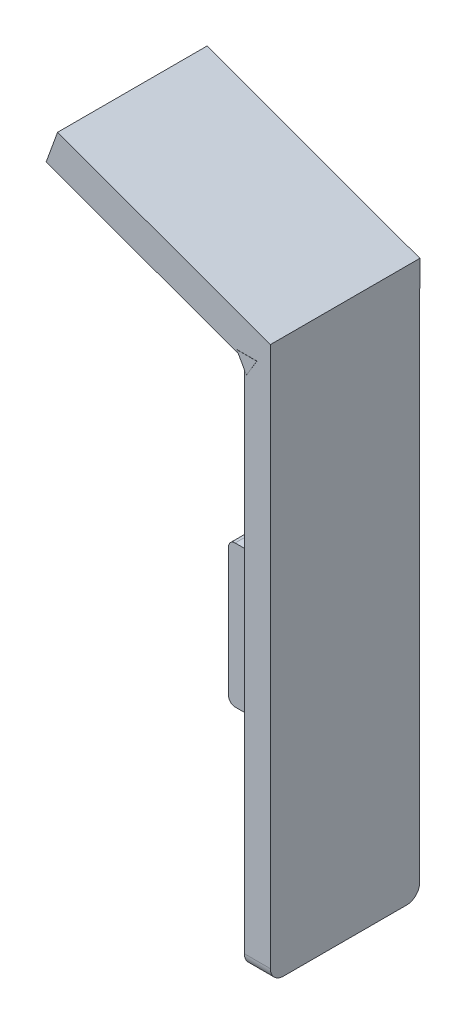
ISO-10303-21;
HEADER;
FILE_DESCRIPTION(('STEP AP214'),'2;1');
FILE_NAME('part.step','',(''),(''),'','','');
FILE_SCHEMA(('AUTOMOTIVE_DESIGN { 1 0 10303 214 1 1 1 1 }'));
ENDSEC;
DATA;
#1=APPLICATION_CONTEXT('core data for automotive mechanical design processes');
#2=APPLICATION_PROTOCOL_DEFINITION('international standard','automotive_design',2000,#1);
#3=PRODUCT_CONTEXT('',#1,'mechanical');
#4=PRODUCT('Part','Part','',(#3));
#5=PRODUCT_RELATED_PRODUCT_CATEGORY('part','',(#4));
#6=PRODUCT_DEFINITION_FORMATION('','',#4);
#7=PRODUCT_DEFINITION_CONTEXT('part definition',#1,'design');
#8=PRODUCT_DEFINITION('design','',#6,#7);
#9=PRODUCT_DEFINITION_SHAPE('','',#8);
#10=(LENGTH_UNIT() NAMED_UNIT(*) SI_UNIT(.MILLI.,.METRE.));
#11=(NAMED_UNIT(*) PLANE_ANGLE_UNIT() SI_UNIT($,.RADIAN.));
#12=(NAMED_UNIT(*) SI_UNIT($,.STERADIAN.) SOLID_ANGLE_UNIT());
#13=UNCERTAINTY_MEASURE_WITH_UNIT(LENGTH_MEASURE(1.E-05),#10,'distance_accuracy_value','');
#14=(GEOMETRIC_REPRESENTATION_CONTEXT(3) GLOBAL_UNCERTAINTY_ASSIGNED_CONTEXT((#13)) GLOBAL_UNIT_ASSIGNED_CONTEXT((#10,
#11,#12)) REPRESENTATION_CONTEXT('',''));
#15=CARTESIAN_POINT('',(0.,0.,0.));
#16=DIRECTION('',(0.,0.,1.));
#17=DIRECTION('',(1.,0.,0.));
#18=AXIS2_PLACEMENT_3D('',#15,#16,#17);
#19=CARTESIAN_POINT('',(-4.,-58.4509756097561,22.93));
#20=DIRECTION('',(1.,0.,0.));
#21=DIRECTION('',(0.,0.,-1.));
#22=AXIS2_PLACEMENT_3D('',#19,#20,#21);
#23=PLANE('',#22);
#24=DIRECTION('',(0.,-1.,0.));
#25=VECTOR('',#24,1.);
#26=CARTESIAN_POINT('',(-4.,12.4645017921239,7.75143133707434));
#27=LINE('',#26,#25);
#28=CARTESIAN_POINT('',(-4.,12.4645017921239,7.75143133707434));
#29=VERTEX_POINT('',#28);
#30=CARTESIAN_POINT('',(-4.,10.4645017921239,7.75143133707434));
#31=VERTEX_POINT('',#30);
#32=EDGE_CURVE('E254',#29,#31,#27,.T.);
#33=ORIENTED_EDGE('',*,*,#32,.F.);
#34=DIRECTION('',(0.,0.,-1.));
#35=VECTOR('',#34,1.);
#36=CARTESIAN_POINT('',(-4.,12.4645017921239,10.7514313370743));
#37=LINE('',#36,#35);
#38=CARTESIAN_POINT('',(-4.,12.4645017921239,10.7514313370743));
#39=VERTEX_POINT('',#38);
#40=EDGE_CURVE('E259',#39,#29,#37,.T.);
#41=ORIENTED_EDGE('',*,*,#40,.F.);
#42=DIRECTION('',(0.,-1.,0.));
#43=VECTOR('',#42,1.);
#44=CARTESIAN_POINT('',(-4.,15.4645017921239,10.7514313370743));
#45=LINE('',#44,#43);
#46=CARTESIAN_POINT('',(-4.,15.4645017921239,10.7514313370743));
#47=VERTEX_POINT('',#46);
#48=EDGE_CURVE('E279',#47,#39,#45,.T.);
#49=ORIENTED_EDGE('',*,*,#48,.F.);
#50=DIRECTION('',(0.,0.,-1.));
#51=VECTOR('',#50,1.);
#52=CARTESIAN_POINT('',(-4.,15.4645017921239,12.7514313370743));
#53=LINE('',#52,#51);
#54=CARTESIAN_POINT('',(-4.,15.4645017921239,12.7514313370743));
#55=VERTEX_POINT('',#54);
#56=EDGE_CURVE('E276',#55,#47,#53,.T.);
#57=ORIENTED_EDGE('',*,*,#56,.F.);
#58=DIRECTION('',(0.,1.,0.));
#59=VECTOR('',#58,1.);
#60=CARTESIAN_POINT('',(-4.,10.4645017921239,12.7514313370743));
#61=LINE('',#60,#59);
#62=CARTESIAN_POINT('',(-4.,10.4645017921239,12.7514313370743));
#63=VERTEX_POINT('',#62);
#64=EDGE_CURVE('E273',#63,#55,#61,.T.);
#65=ORIENTED_EDGE('',*,*,#64,.F.);
#66=DIRECTION('',(0.,0.,1.));
#67=VECTOR('',#66,1.);
#68=CARTESIAN_POINT('',(-4.,10.4645017921239,7.75143133707434));
#69=LINE('',#68,#67);
#70=EDGE_CURVE('E59',#31,#63,#69,.T.);
#71=ORIENTED_EDGE('',*,*,#70,.F.);
#72=EDGE_LOOP('',(#33,#41,#49,#57,#65,#71));
#73=FACE_BOUND('',#72,.T.);
#74=DIRECTION('',(0.,0.,1.));
#75=VECTOR('',#74,1.);
#76=CARTESIAN_POINT('',(-4.,21.2877543682845,22.93));
#77=LINE('',#76,#75);
#78=CARTESIAN_POINT('',(-3.99999999999997,21.2877543682844,0.));
#79=VERTEX_POINT('',#78);
#80=CARTESIAN_POINT('',(-3.99999999999999,21.2877543682844,22.93));
#81=VERTEX_POINT('',#80);
#82=EDGE_CURVE('E250',#79,#81,#77,.T.);
#83=ORIENTED_EDGE('',*,*,#82,.F.);
#84=DIRECTION('',(0.,-1.,0.));
#85=VECTOR('',#84,1.);
#86=CARTESIAN_POINT('',(-4.,-58.4509756097561,0.));
#87=LINE('',#86,#85);
#88=CARTESIAN_POINT('',(-4.,-22.4709756097561,0.));
#89=VERTEX_POINT('',#88);
#90=EDGE_CURVE('E359',#79,#89,#87,.T.);
#91=ORIENTED_EDGE('',*,*,#90,.T.);
#92=CARTESIAN_POINT('',(-4.,-22.4709756097561,1.));
#93=DIRECTION('',(1.,0.,0.));
#94=DIRECTION('',(0.,0.,-1.));
#95=AXIS2_PLACEMENT_3D('',#92,#93,#94);
#96=CIRCLE('',#95,1.);
#97=CARTESIAN_POINT('',(-4.,-21.4709756097561,1.));
#98=VERTEX_POINT('',#97);
#99=EDGE_CURVE('E426',#89,#98,#96,.T.);
#100=ORIENTED_EDGE('',*,*,#99,.T.);
#101=DIRECTION('',(0.,0.,1.));
#102=VECTOR('',#101,1.);
#103=CARTESIAN_POINT('',(-4.,-21.4709756097561,22.93));
#104=LINE('',#103,#102);
#105=CARTESIAN_POINT('',(-4.,-21.4709756097561,4.));
#106=VERTEX_POINT('',#105);
#107=EDGE_CURVE('E308',#98,#106,#104,.T.);
#108=ORIENTED_EDGE('',*,*,#107,.T.);
#109=DIRECTION('',(0.,-1.,0.));
#110=VECTOR('',#109,1.);
#111=CARTESIAN_POINT('',(-4.,-58.4509756097561,4.));
#112=LINE('',#111,#110);
#113=CARTESIAN_POINT('',(-4.,-43.2913286370677,4.));
#114=VERTEX_POINT('',#113);
#115=EDGE_CURVE('E315',#106,#114,#112,.T.);
#116=ORIENTED_EDGE('',*,*,#115,.T.);
#117=DIRECTION('',(0.,0.,-1.));
#118=VECTOR('',#117,1.);
#119=CARTESIAN_POINT('',(-4.,-43.2913286370677,22.93));
#120=LINE('',#119,#118);
#121=CARTESIAN_POINT('',(-4.,-43.2913286370677,1.));
#122=VERTEX_POINT('',#121);
#123=EDGE_CURVE('E312',#114,#122,#120,.T.);
#124=ORIENTED_EDGE('',*,*,#123,.T.);
#125=CARTESIAN_POINT('',(-4.,-42.2913286370677,1.));
#126=DIRECTION('',(1.,0.,0.));
#127=DIRECTION('',(0.,0.,-1.));
#128=AXIS2_PLACEMENT_3D('',#125,#126,#127);
#129=CIRCLE('',#128,1.);
#130=CARTESIAN_POINT('',(-4.,-42.2913286370677,0.));
#131=VERTEX_POINT('',#130);
#132=EDGE_CURVE('E423',#122,#131,#129,.T.);
#133=ORIENTED_EDGE('',*,*,#132,.T.);
#134=CARTESIAN_POINT('',(-4.,-56.4509756097561,0.));
#135=VERTEX_POINT('',#134);
#136=EDGE_CURVE('E346',#131,#135,#87,.T.);
#137=ORIENTED_EDGE('',*,*,#136,.T.);
#138=CARTESIAN_POINT('',(-4.,-56.4509756097561,2.));
#139=DIRECTION('',(1.,0.,0.));
#140=DIRECTION('',(0.,0.,-1.));
#141=AXIS2_PLACEMENT_3D('',#138,#139,#140);
#142=CIRCLE('',#141,2.);
#143=CARTESIAN_POINT('',(-4.,-58.4509756097561,2.));
#144=VERTEX_POINT('',#143);
#145=EDGE_CURVE('E383',#135,#144,#142,.F.);
#146=ORIENTED_EDGE('',*,*,#145,.T.);
#147=DIRECTION('',(0.,0.,-1.));
#148=VECTOR('',#147,1.);
#149=CARTESIAN_POINT('',(-4.,-58.4509756097561,22.93));
#150=LINE('',#149,#148);
#151=CARTESIAN_POINT('',(-4.,-58.4509756097561,20.93));
#152=VERTEX_POINT('',#151);
#153=EDGE_CURVE('E366',#152,#144,#150,.T.);
#154=ORIENTED_EDGE('',*,*,#153,.F.);
#155=CARTESIAN_POINT('',(-4.,-56.4509756097561,20.93));
#156=DIRECTION('',(1.,0.,0.));
#157=DIRECTION('',(0.,0.,-1.));
#158=AXIS2_PLACEMENT_3D('',#155,#156,#157);
#159=CIRCLE('',#158,2.);
#160=CARTESIAN_POINT('',(-4.,-56.4509756097561,22.93));
#161=VERTEX_POINT('',#160);
#162=EDGE_CURVE('E385',#152,#161,#159,.F.);
#163=ORIENTED_EDGE('',*,*,#162,.T.);
#164=DIRECTION('',(0.,-1.,0.));
#165=VECTOR('',#164,1.);
#166=CARTESIAN_POINT('',(-4.,-58.4509756097561,22.93));
#167=LINE('',#166,#165);
#168=EDGE_CURVE('E353',#81,#161,#167,.T.);
#169=ORIENTED_EDGE('',*,*,#168,.F.);
#170=EDGE_LOOP('',(#83,#91,#100,#108,#116,#124,#133,#137,#146,#154,#163,#169));
#171=FACE_BOUND('',#170,.T.);
#172=ADVANCED_FACE('F36',(#73,#171),#23,.F.);
#173=CARTESIAN_POINT('',(0.,0.,22.93));
#174=DIRECTION('',(0.,0.,-1.));
#175=DIRECTION('',(-1.,0.,0.));
#176=AXIS2_PLACEMENT_3D('',#173,#174,#175);
#177=PLANE('',#176);
#178=DIRECTION('',(0.493012571980879,-0.870022185848613,0.));
#179=VECTOR('',#178,1.);
#180=CARTESIAN_POINT('',(6.10324199144245,3.45850379515071,22.93));
#181=LINE('',#180,#179);
#182=CARTESIAN_POINT('',(-5.15196674366272,23.3206368571011,22.93));
#183=VERTEX_POINT('',#182);
#184=CARTESIAN_POINT('',(-4.90043401385705,22.8767555692087,22.93));
#185=VERTEX_POINT('',#184);
#186=EDGE_CURVE('E242',#183,#185,#181,.T.);
#187=ORIENTED_EDGE('',*,*,#186,.F.);
#188=DIRECTION('',(-1.,0.,0.));
#189=VECTOR('',#188,1.);
#190=CARTESIAN_POINT('',(0.,23.3206368571011,22.93));
#191=LINE('',#190,#189);
#192=CARTESIAN_POINT('',(-2.075100002577,23.3206368571011,22.93));
#193=VERTEX_POINT('',#192);
#194=EDGE_CURVE('E11',#193,#183,#191,.T.);
#195=ORIENTED_EDGE('',*,*,#194,.F.);
#196=DIRECTION('',(0.513877207737596,0.857863751051303,0.));
#197=VECTOR('',#196,1.);
#198=CARTESIAN_POINT('',(-11.8077197302464,7.0730556423339,22.93));
#199=LINE('',#198,#197);
#200=CARTESIAN_POINT('',(-3.65623169206681,20.6811044131083,22.93));
#201=VERTEX_POINT('',#200);
#202=EDGE_CURVE('E252',#201,#193,#199,.T.);
#203=ORIENTED_EDGE('',*,*,#202,.F.);
#204=EDGE_CURVE('E244',#81,#201,#181,.T.);
#205=ORIENTED_EDGE('',*,*,#204,.F.);
#206=ORIENTED_EDGE('',*,*,#168,.T.);
#207=DIRECTION('',(1.,0.,0.));
#208=VECTOR('',#207,1.);
#209=CARTESIAN_POINT('',(0.,-56.4509756097561,22.93));
#210=LINE('',#209,#208);
#211=CARTESIAN_POINT('',(0.,-56.4509756097561,22.93));
#212=VERTEX_POINT('',#211);
#213=EDGE_CURVE('E371',#161,#212,#210,.T.);
#214=ORIENTED_EDGE('',*,*,#213,.T.);
#215=DIRECTION('',(0.,1.,0.));
#216=VECTOR('',#215,1.);
#217=CARTESIAN_POINT('',(0.,26.5490243902439,22.93));
#218=LINE('',#217,#216);
#219=CARTESIAN_POINT('',(0.,26.5490243902439,22.93));
#220=VERTEX_POINT('',#219);
#221=EDGE_CURVE('E355',#212,#220,#218,.T.);
#222=ORIENTED_EDGE('',*,*,#221,.T.);
#223=DIRECTION('',(-0.93969262078591,0.342020143325664,0.));
#224=VECTOR('',#223,1.);
#225=CARTESIAN_POINT('',(-32.6819352806682,38.4442760306214,22.93));
#226=LINE('',#225,#224);
#227=CARTESIAN_POINT('',(-32.6819352806682,38.4442760306214,22.93));
#228=VERTEX_POINT('',#227);
#229=EDGE_CURVE('E318',#220,#228,#226,.T.);
#230=ORIENTED_EDGE('',*,*,#229,.T.);
#231=DIRECTION('',(-0.342020143325664,-0.93969262078591,0.));
#232=VECTOR('',#231,1.);
#233=CARTESIAN_POINT('',(-34.4354216138033,33.6266119250103,22.93));
#234=LINE('',#233,#232);
#235=CARTESIAN_POINT('',(-34.4354216138033,33.6266119250103,22.93));
#236=VERTEX_POINT('',#235);
#237=EDGE_CURVE('E338',#228,#236,#234,.T.);
#238=ORIENTED_EDGE('',*,*,#237,.T.);
#239=DIRECTION('',(0.93969262078591,-0.342020143325664,0.));
#240=VECTOR('',#239,1.);
#241=CARTESIAN_POINT('',(-4.,22.5490243902439,22.93));
#242=LINE('',#241,#240);
#243=EDGE_CURVE('E323',#236,#185,#242,.T.);
#244=ORIENTED_EDGE('',*,*,#243,.T.);
#245=EDGE_LOOP('',(#187,#195,#203,#205,#206,#214,#222,#230,#238,#244));
#246=FACE_BOUND('',#245,.T.);
#247=ADVANCED_FACE('F444',(#246),#177,.F.);
#248=CARTESIAN_POINT('',(-4.,22.5490243902439,-0.0199999999999992));
#249=DIRECTION('',(-0.342020143325664,-0.93969262078591,0.));
#250=DIRECTION('',(0.93969262078591,-0.342020143325664,0.));
#251=AXIS2_PLACEMENT_3D('',#248,#249,#250);
#252=PLANE('',#251);
#253=DIRECTION('',(-0.93969262078591,0.342020143325664,0.));
#254=VECTOR('',#253,1.);
#255=CARTESIAN_POINT('',(-4.,22.5490243902439,0.));
#256=LINE('',#255,#254);
#257=CARTESIAN_POINT('',(-4.,22.5490243902439,0.));
#258=VERTEX_POINT('',#257);
#259=CARTESIAN_POINT('',(-4.90043401385705,22.8767555692087,0.));
#260=VERTEX_POINT('',#259);
#261=EDGE_CURVE('E428',#258,#260,#256,.T.);
#262=ORIENTED_EDGE('',*,*,#261,.T.);
#263=DIRECTION('',(0.,0.,1.));
#264=VECTOR('',#263,1.);
#265=CARTESIAN_POINT('',(-4.90043401385705,22.8767555692087,-0.0199999999999992));
#266=LINE('',#265,#264);
#267=EDGE_CURVE('E44',#260,#185,#266,.T.);
#268=ORIENTED_EDGE('',*,*,#267,.T.);
#269=ORIENTED_EDGE('',*,*,#243,.F.);
#270=DIRECTION('',(0.,0.,1.));
#271=VECTOR('',#270,1.);
#272=CARTESIAN_POINT('',(-34.4354216138033,33.6266119250103,-0.0199999999999992));
#273=LINE('',#272,#271);
#274=CARTESIAN_POINT('',(-34.4354216138033,33.6266119250103,-0.0199999999999992));
#275=VERTEX_POINT('',#274);
#276=EDGE_CURVE('E350',#275,#236,#273,.T.);
#277=ORIENTED_EDGE('',*,*,#276,.F.);
#278=DIRECTION('',(0.93969262078591,-0.342020143325664,0.));
#279=VECTOR('',#278,1.);
#280=CARTESIAN_POINT('',(-4.,22.5490243902439,-0.0199999999999992));
#281=LINE('',#280,#279);
#282=CARTESIAN_POINT('',(-4.,22.5490243902439,-0.0199999999999992));
#283=VERTEX_POINT('',#282);
#284=EDGE_CURVE('E329',#275,#283,#281,.T.);
#285=ORIENTED_EDGE('',*,*,#284,.T.);
#286=DIRECTION('',(0.,0.,1.));
#287=VECTOR('',#286,1.);
#288=CARTESIAN_POINT('',(-4.,22.5490243902439,-0.0199999999999992));
#289=LINE('',#288,#287);
#290=EDGE_CURVE('E347',#283,#258,#289,.T.);
#291=ORIENTED_EDGE('',*,*,#290,.T.);
#292=EDGE_LOOP('',(#262,#268,#269,#277,#285,#291));
#293=FACE_BOUND('',#292,.T.);
#294=ADVANCED_FACE('F442',(#293),#252,.T.);
#295=CARTESIAN_POINT('',(0.,-58.4509756097561,22.93));
#296=DIRECTION('',(0.,1.,0.));
#297=DIRECTION('',(0.,0.,1.));
#298=AXIS2_PLACEMENT_3D('',#295,#296,#297);
#299=PLANE('',#298);
#300=DIRECTION('',(0.,0.,-1.));
#301=VECTOR('',#300,1.);
#302=CARTESIAN_POINT('',(0.,-58.4509756097561,22.93));
#303=LINE('',#302,#301);
#304=CARTESIAN_POINT('',(0.,-58.4509756097561,20.93));
#305=VERTEX_POINT('',#304);
#306=CARTESIAN_POINT('',(0.,-58.4509756097561,2.));
#307=VERTEX_POINT('',#306);
#308=EDGE_CURVE('E363',#305,#307,#303,.T.);
#309=ORIENTED_EDGE('',*,*,#308,.F.);
#310=DIRECTION('',(1.,0.,0.));
#311=VECTOR('',#310,1.);
#312=CARTESIAN_POINT('',(0.,-58.4509756097561,20.93));
#313=LINE('',#312,#311);
#314=EDGE_CURVE('E381',#305,#152,#313,.F.);
#315=ORIENTED_EDGE('',*,*,#314,.T.);
#316=ORIENTED_EDGE('',*,*,#153,.T.);
#317=DIRECTION('',(1.,0.,0.));
#318=VECTOR('',#317,1.);
#319=CARTESIAN_POINT('',(0.,-58.4509756097561,2.));
#320=LINE('',#319,#318);
#321=EDGE_CURVE('E378',#144,#307,#320,.T.);
#322=ORIENTED_EDGE('',*,*,#321,.T.);
#323=EDGE_LOOP('',(#309,#315,#316,#322));
#324=FACE_BOUND('',#323,.T.);
#325=ADVANCED_FACE('F469',(#324),#299,.F.);
#326=CARTESIAN_POINT('',(0.,26.5490243902439,22.93));
#327=DIRECTION('',(-1.,0.,0.));
#328=DIRECTION('',(0.,-1.,0.));
#329=AXIS2_PLACEMENT_3D('',#326,#327,#328);
#330=PLANE('',#329);
#331=DIRECTION('',(0.,1.,0.));
#332=VECTOR('',#331,1.);
#333=CARTESIAN_POINT('',(0.,26.5490243902439,0.));
#334=LINE('',#333,#332);
#335=CARTESIAN_POINT('',(0.,-56.4509756097561,0.));
#336=VERTEX_POINT('',#335);
#337=CARTESIAN_POINT('',(0.,22.5490243902439,0.));
#338=VERTEX_POINT('',#337);
#339=EDGE_CURVE('E356',#336,#338,#334,.T.);
#340=ORIENTED_EDGE('',*,*,#339,.T.);
#341=DIRECTION('',(0.,0.,1.));
#342=VECTOR('',#341,1.);
#343=CARTESIAN_POINT('',(0.,22.5490243902439,-0.0199999999999992));
#344=LINE('',#343,#342);
#345=CARTESIAN_POINT('',(0.,22.5490243902439,-0.0199999999999992));
#346=VERTEX_POINT('',#345);
#347=EDGE_CURVE('E343',#346,#338,#344,.T.);
#348=ORIENTED_EDGE('',*,*,#347,.F.);
#349=DIRECTION('',(0.,1.,0.));
#350=VECTOR('',#349,1.);
#351=CARTESIAN_POINT('',(0.,26.5490243902439,-0.0199999999999992));
#352=LINE('',#351,#350);
#353=CARTESIAN_POINT('',(0.,26.5490243902439,-0.0199999999999992));
#354=VERTEX_POINT('',#353);
#355=EDGE_CURVE('E319',#346,#354,#352,.T.);
#356=ORIENTED_EDGE('',*,*,#355,.T.);
#357=DIRECTION('',(0.,0.,-1.));
#358=VECTOR('',#357,1.);
#359=CARTESIAN_POINT('',(0.,26.5490243902439,22.93));
#360=LINE('',#359,#358);
#361=EDGE_CURVE('E358',#220,#354,#360,.T.);
#362=ORIENTED_EDGE('',*,*,#361,.F.);
#363=ORIENTED_EDGE('',*,*,#221,.F.);
#364=CARTESIAN_POINT('',(0.,-56.4509756097561,20.93));
#365=DIRECTION('',(-1.,0.,0.));
#366=DIRECTION('',(0.,-1.,0.));
#367=AXIS2_PLACEMENT_3D('',#364,#365,#366);
#368=CIRCLE('',#367,2.);
#369=EDGE_CURVE('E376',#212,#305,#368,.F.);
#370=ORIENTED_EDGE('',*,*,#369,.T.);
#371=ORIENTED_EDGE('',*,*,#308,.T.);
#372=CARTESIAN_POINT('',(0.,-56.4509756097561,2.));
#373=DIRECTION('',(-1.,0.,0.));
#374=DIRECTION('',(0.,-1.,0.));
#375=AXIS2_PLACEMENT_3D('',#372,#373,#374);
#376=CIRCLE('',#375,2.);
#377=EDGE_CURVE('E374',#307,#336,#376,.F.);
#378=ORIENTED_EDGE('',*,*,#377,.T.);
#379=EDGE_LOOP('',(#340,#348,#356,#362,#363,#370,#371,#378));
#380=FACE_BOUND('',#379,.T.);
#381=ADVANCED_FACE('F462',(#380),#330,.F.);
#382=CARTESIAN_POINT('',(0.,0.,0.));
#383=DIRECTION('',(0.,0.,-1.));
#384=DIRECTION('',(-1.,0.,0.));
#385=AXIS2_PLACEMENT_3D('',#382,#383,#384);
#386=PLANE('',#385);
#387=ORIENTED_EDGE('',*,*,#90,.F.);
#388=DIRECTION('',(0.493012571980879,-0.870022185848613,0.));
#389=VECTOR('',#388,1.);
#390=CARTESIAN_POINT('',(-5.15196674366272,23.3206368571011,0.));
#391=LINE('',#390,#389);
#392=EDGE_CURVE('E51',#260,#79,#391,.T.);
#393=ORIENTED_EDGE('',*,*,#392,.F.);
#394=ORIENTED_EDGE('',*,*,#261,.F.);
#395=DIRECTION('',(-1.,0.,0.));
#396=VECTOR('',#395,1.);
#397=CARTESIAN_POINT('',(0.,22.5490243902439,0.));
#398=LINE('',#397,#396);
#399=EDGE_CURVE('E369',#338,#258,#398,.T.);
#400=ORIENTED_EDGE('',*,*,#399,.F.);
#401=ORIENTED_EDGE('',*,*,#339,.F.);
#402=DIRECTION('',(1.,0.,0.));
#403=VECTOR('',#402,1.);
#404=CARTESIAN_POINT('',(-4.,-56.4509756097561,0.));
#405=LINE('',#404,#403);
#406=EDGE_CURVE('E388',#336,#135,#405,.F.);
#407=ORIENTED_EDGE('',*,*,#406,.T.);
#408=ORIENTED_EDGE('',*,*,#136,.F.);
#409=DIRECTION('',(1.,0.,0.));
#410=VECTOR('',#409,1.);
#411=CARTESIAN_POINT('',(0.,-42.2913286370677,0.));
#412=LINE('',#411,#410);
#413=CARTESIAN_POINT('',(-24.35,-42.2913286370677,0.));
#414=VERTEX_POINT('',#413);
#415=EDGE_CURVE('E413',#131,#414,#412,.F.);
#416=ORIENTED_EDGE('',*,*,#415,.T.);
#417=DIRECTION('',(0.,1.,0.));
#418=VECTOR('',#417,1.);
#419=CARTESIAN_POINT('',(-24.35,0.,0.));
#420=LINE('',#419,#418);
#421=CARTESIAN_POINT('',(-24.35,-22.4709756097561,0.));
#422=VERTEX_POINT('',#421);
#423=EDGE_CURVE('E411',#414,#422,#420,.T.);
#424=ORIENTED_EDGE('',*,*,#423,.T.);
#425=DIRECTION('',(1.,0.,0.));
#426=VECTOR('',#425,1.);
#427=CARTESIAN_POINT('',(0.,-22.4709756097561,0.));
#428=LINE('',#427,#426);
#429=EDGE_CURVE('E408',#422,#89,#428,.T.);
#430=ORIENTED_EDGE('',*,*,#429,.T.);
#431=EDGE_LOOP('',(#387,#393,#394,#400,#401,#407,#408,#416,#424,#430));
#432=FACE_BOUND('',#431,.T.);
#433=ADVANCED_FACE('F460',(#432),#386,.T.);
#434=CARTESIAN_POINT('',(0.,22.5490243902439,-0.0199999999999992));
#435=DIRECTION('',(0.,-1.,0.));
#436=DIRECTION('',(0.,0.,-1.));
#437=AXIS2_PLACEMENT_3D('',#434,#435,#436);
#438=PLANE('',#437);
#439=ORIENTED_EDGE('',*,*,#347,.T.);
#440=ORIENTED_EDGE('',*,*,#399,.T.);
#441=ORIENTED_EDGE('',*,*,#290,.F.);
#442=DIRECTION('',(1.,0.,0.));
#443=VECTOR('',#442,1.);
#444=CARTESIAN_POINT('',(0.,22.5490243902439,-0.0199999999999992));
#445=LINE('',#444,#443);
#446=EDGE_CURVE('E332',#283,#346,#445,.T.);
#447=ORIENTED_EDGE('',*,*,#446,.T.);
#448=EDGE_LOOP('',(#439,#440,#441,#447));
#449=FACE_BOUND('',#448,.T.);
#450=ADVANCED_FACE('F457',(#449),#438,.T.);
#451=CARTESIAN_POINT('',(-34.4354216138033,33.6266119250103,-0.0199999999999992));
#452=DIRECTION('',(-0.93969262078591,0.342020143325664,0.));
#453=DIRECTION('',(-0.342020143325664,-0.93969262078591,0.));
#454=AXIS2_PLACEMENT_3D('',#451,#452,#453);
#455=PLANE('',#454);
#456=ORIENTED_EDGE('',*,*,#237,.F.);
#457=DIRECTION('',(0.,0.,1.));
#458=VECTOR('',#457,1.);
#459=CARTESIAN_POINT('',(-32.6819352806682,38.4442760306214,-0.0199999999999992));
#460=LINE('',#459,#458);
#461=CARTESIAN_POINT('',(-32.6819352806682,38.4442760306214,-0.0199999999999992));
#462=VERTEX_POINT('',#461);
#463=EDGE_CURVE('E335',#462,#228,#460,.T.);
#464=ORIENTED_EDGE('',*,*,#463,.F.);
#465=DIRECTION('',(-0.342020143325664,-0.93969262078591,0.));
#466=VECTOR('',#465,1.);
#467=CARTESIAN_POINT('',(-34.4354216138033,33.6266119250103,-0.0199999999999992));
#468=LINE('',#467,#466);
#469=EDGE_CURVE('E326',#462,#275,#468,.T.);
#470=ORIENTED_EDGE('',*,*,#469,.T.);
#471=ORIENTED_EDGE('',*,*,#276,.T.);
#472=EDGE_LOOP('',(#456,#464,#470,#471));
#473=FACE_BOUND('',#472,.T.);
#474=ADVANCED_FACE('F448',(#473),#455,.T.);
#475=CARTESIAN_POINT('',(-32.6819352806682,38.4442760306214,-0.0199999999999992));
#476=DIRECTION('',(0.342020143325664,0.93969262078591,0.));
#477=DIRECTION('',(-0.93969262078591,0.342020143325664,0.));
#478=AXIS2_PLACEMENT_3D('',#475,#476,#477);
#479=PLANE('',#478);
#480=ORIENTED_EDGE('',*,*,#229,.F.);
#481=ORIENTED_EDGE('',*,*,#361,.T.);
#482=DIRECTION('',(-0.93969262078591,0.342020143325664,0.));
#483=VECTOR('',#482,1.);
#484=CARTESIAN_POINT('',(-32.6819352806682,38.4442760306214,-0.0199999999999992));
#485=LINE('',#484,#483);
#486=EDGE_CURVE('E322',#354,#462,#485,.T.);
#487=ORIENTED_EDGE('',*,*,#486,.T.);
#488=ORIENTED_EDGE('',*,*,#463,.T.);
#489=EDGE_LOOP('',(#480,#481,#487,#488));
#490=FACE_BOUND('',#489,.T.);
#491=ADVANCED_FACE('F615',(#490),#479,.T.);
#492=CARTESIAN_POINT('',(0.,0.,-0.0199999999999992));
#493=DIRECTION('',(0.,0.,-1.));
#494=DIRECTION('',(-1.,0.,0.));
#495=AXIS2_PLACEMENT_3D('',#492,#493,#494);
#496=PLANE('',#495);
#497=ORIENTED_EDGE('',*,*,#355,.F.);
#498=ORIENTED_EDGE('',*,*,#446,.F.);
#499=ORIENTED_EDGE('',*,*,#284,.F.);
#500=ORIENTED_EDGE('',*,*,#469,.F.);
#501=ORIENTED_EDGE('',*,*,#486,.F.);
#502=EDGE_LOOP('',(#497,#498,#499,#500,#501));
#503=FACE_BOUND('',#502,.T.);
#504=ADVANCED_FACE('F454',(#503),#496,.T.);
#505=CARTESIAN_POINT('',(0.,-56.4509756097561,20.93));
#506=DIRECTION('',(1.,0.,0.));
#507=DIRECTION('',(0.,0.,-1.));
#508=AXIS2_PLACEMENT_3D('',#505,#506,#507);
#509=CYLINDRICAL_SURFACE('',#508,2.);
#510=ORIENTED_EDGE('',*,*,#162,.F.);
#511=ORIENTED_EDGE('',*,*,#314,.F.);
#512=ORIENTED_EDGE('',*,*,#369,.F.);
#513=ORIENTED_EDGE('',*,*,#213,.F.);
#514=EDGE_LOOP('',(#510,#511,#512,#513));
#515=FACE_BOUND('',#514,.T.);
#516=ADVANCED_FACE('F481',(#515),#509,.T.);
#517=CARTESIAN_POINT('',(0.,-56.4509756097561,2.));
#518=DIRECTION('',(-1.,0.,0.));
#519=DIRECTION('',(0.,0.,1.));
#520=AXIS2_PLACEMENT_3D('',#517,#518,#519);
#521=CYLINDRICAL_SURFACE('',#520,2.);
#522=ORIENTED_EDGE('',*,*,#145,.F.);
#523=ORIENTED_EDGE('',*,*,#406,.F.);
#524=ORIENTED_EDGE('',*,*,#377,.F.);
#525=ORIENTED_EDGE('',*,*,#321,.F.);
#526=EDGE_LOOP('',(#522,#523,#524,#525));
#527=FACE_BOUND('',#526,.T.);
#528=ADVANCED_FACE('F484',(#527),#521,.T.);
#529=CARTESIAN_POINT('',(-25.35,-43.2913286370677,4.));
#530=DIRECTION('',(0.,0.,1.));
#531=DIRECTION('',(1.,0.,0.));
#532=AXIS2_PLACEMENT_3D('',#529,#530,#531);
#533=PLANE('',#532);
#534=DIRECTION('',(0.,-1.,0.));
#535=VECTOR('',#534,1.);
#536=CARTESIAN_POINT('',(-25.35,-43.2913286370677,4.));
#537=LINE('',#536,#535);
#538=CARTESIAN_POINT('',(-25.35,-22.4709756097561,4.));
#539=VERTEX_POINT('',#538);
#540=CARTESIAN_POINT('',(-25.35,-42.2913286370677,4.));
#541=VERTEX_POINT('',#540);
#542=EDGE_CURVE('E301',#539,#541,#537,.T.);
#543=ORIENTED_EDGE('',*,*,#542,.T.);
#544=CARTESIAN_POINT('',(-24.35,-42.2913286370677,4.));
#545=DIRECTION('',(0.,0.,1.));
#546=DIRECTION('',(1.,0.,0.));
#547=AXIS2_PLACEMENT_3D('',#544,#545,#546);
#548=CIRCLE('',#547,1.);
#549=CARTESIAN_POINT('',(-24.35,-43.2913286370677,4.));
#550=VERTEX_POINT('',#549);
#551=EDGE_CURVE('E401',#541,#550,#548,.T.);
#552=ORIENTED_EDGE('',*,*,#551,.T.);
#553=DIRECTION('',(1.,0.,0.));
#554=VECTOR('',#553,1.);
#555=CARTESIAN_POINT('',(-25.35,-43.2913286370677,4.));
#556=LINE('',#555,#554);
#557=EDGE_CURVE('E306',#550,#114,#556,.T.);
#558=ORIENTED_EDGE('',*,*,#557,.T.);
#559=ORIENTED_EDGE('',*,*,#115,.F.);
#560=DIRECTION('',(1.,0.,0.));
#561=VECTOR('',#560,1.);
#562=CARTESIAN_POINT('',(-25.35,-21.4709756097561,4.));
#563=LINE('',#562,#561);
#564=CARTESIAN_POINT('',(-24.35,-21.4709756097561,4.));
#565=VERTEX_POINT('',#564);
#566=EDGE_CURVE('E304',#565,#106,#563,.T.);
#567=ORIENTED_EDGE('',*,*,#566,.F.);
#568=CARTESIAN_POINT('',(-24.35,-22.4709756097561,4.));
#569=DIRECTION('',(0.,0.,1.));
#570=DIRECTION('',(1.,0.,0.));
#571=AXIS2_PLACEMENT_3D('',#568,#569,#570);
#572=CIRCLE('',#571,1.);
#573=EDGE_CURVE('E399',#565,#539,#572,.T.);
#574=ORIENTED_EDGE('',*,*,#573,.T.);
#575=EDGE_LOOP('',(#543,#552,#558,#559,#567,#574));
#576=FACE_BOUND('',#575,.T.);
#577=ADVANCED_FACE('F488',(#576),#533,.T.);
#578=CARTESIAN_POINT('',(-25.35,-43.2913286370677,0.));
#579=DIRECTION('',(0.,-1.,0.));
#580=DIRECTION('',(0.,0.,-1.));
#581=AXIS2_PLACEMENT_3D('',#578,#579,#580);
#582=PLANE('',#581);
#583=DIRECTION('',(0.,0.,-1.));
#584=VECTOR('',#583,1.);
#585=CARTESIAN_POINT('',(-24.35,-43.2913286370677,0.));
#586=LINE('',#585,#584);
#587=CARTESIAN_POINT('',(-24.35,-43.2913286370677,1.));
#588=VERTEX_POINT('',#587);
#589=EDGE_CURVE('E391',#550,#588,#586,.T.);
#590=ORIENTED_EDGE('',*,*,#589,.T.);
#591=DIRECTION('',(1.,0.,0.));
#592=VECTOR('',#591,1.);
#593=CARTESIAN_POINT('',(-25.35,-43.2913286370677,1.));
#594=LINE('',#593,#592);
#595=EDGE_CURVE('E419',#588,#122,#594,.T.);
#596=ORIENTED_EDGE('',*,*,#595,.T.);
#597=ORIENTED_EDGE('',*,*,#123,.F.);
#598=ORIENTED_EDGE('',*,*,#557,.F.);
#599=EDGE_LOOP('',(#590,#596,#597,#598));
#600=FACE_BOUND('',#599,.T.);
#601=ADVANCED_FACE('F535',(#600),#582,.T.);
#602=CARTESIAN_POINT('',(-25.35,-21.4709756097561,4.));
#603=DIRECTION('',(0.,1.,0.));
#604=DIRECTION('',(0.,0.,1.));
#605=AXIS2_PLACEMENT_3D('',#602,#603,#604);
#606=PLANE('',#605);
#607=ORIENTED_EDGE('',*,*,#107,.F.);
#608=DIRECTION('',(1.,0.,0.));
#609=VECTOR('',#608,1.);
#610=CARTESIAN_POINT('',(-25.35,-21.4709756097561,1.));
#611=LINE('',#610,#609);
#612=CARTESIAN_POINT('',(-24.35,-21.4709756097561,1.));
#613=VERTEX_POINT('',#612);
#614=EDGE_CURVE('E421',#98,#613,#611,.F.);
#615=ORIENTED_EDGE('',*,*,#614,.T.);
#616=DIRECTION('',(0.,0.,1.));
#617=VECTOR('',#616,1.);
#618=CARTESIAN_POINT('',(-24.35,-21.4709756097561,4.));
#619=LINE('',#618,#617);
#620=EDGE_CURVE('E403',#613,#565,#619,.T.);
#621=ORIENTED_EDGE('',*,*,#620,.T.);
#622=ORIENTED_EDGE('',*,*,#566,.T.);
#623=EDGE_LOOP('',(#607,#615,#621,#622));
#624=FACE_BOUND('',#623,.T.);
#625=ADVANCED_FACE('F545',(#624),#606,.T.);
#626=CARTESIAN_POINT('',(-25.35,0.,0.));
#627=DIRECTION('',(-1.,0.,0.));
#628=DIRECTION('',(0.,0.,1.));
#629=AXIS2_PLACEMENT_3D('',#626,#627,#628);
#630=PLANE('',#629);
#631=DIRECTION('',(0.,0.,1.));
#632=VECTOR('',#631,1.);
#633=CARTESIAN_POINT('',(-25.35,-22.4709756097561,0.));
#634=LINE('',#633,#632);
#635=CARTESIAN_POINT('',(-25.35,-22.4709756097561,1.));
#636=VERTEX_POINT('',#635);
#637=EDGE_CURVE('E394',#539,#636,#634,.F.);
#638=ORIENTED_EDGE('',*,*,#637,.T.);
#639=DIRECTION('',(0.,1.,0.));
#640=VECTOR('',#639,1.);
#641=CARTESIAN_POINT('',(-25.35,0.,1.));
#642=LINE('',#641,#640);
#643=CARTESIAN_POINT('',(-25.35,-42.2913286370677,1.));
#644=VERTEX_POINT('',#643);
#645=EDGE_CURVE('E415',#636,#644,#642,.F.);
#646=ORIENTED_EDGE('',*,*,#645,.T.);
#647=DIRECTION('',(0.,0.,-1.));
#648=VECTOR('',#647,1.);
#649=CARTESIAN_POINT('',(-25.35,-42.2913286370677,0.));
#650=LINE('',#649,#648);
#651=EDGE_CURVE('E397',#644,#541,#650,.F.);
#652=ORIENTED_EDGE('',*,*,#651,.T.);
#653=ORIENTED_EDGE('',*,*,#542,.F.);
#654=EDGE_LOOP('',(#638,#646,#652,#653));
#655=FACE_BOUND('',#654,.T.);
#656=ADVANCED_FACE('F494',(#655),#630,.T.);
#657=CARTESIAN_POINT('',(-24.35,-42.2913286370677,0.));
#658=DIRECTION('',(0.,0.,-1.));
#659=DIRECTION('',(-1.,0.,0.));
#660=AXIS2_PLACEMENT_3D('',#657,#658,#659);
#661=CYLINDRICAL_SURFACE('',#660,1.);
#662=ORIENTED_EDGE('',*,*,#651,.F.);
#663=CARTESIAN_POINT('',(-24.35,-42.2913286370677,1.));
#664=DIRECTION('',(0.,0.,-1.));
#665=DIRECTION('',(-1.,0.,0.));
#666=AXIS2_PLACEMENT_3D('',#663,#664,#665);
#667=CIRCLE('',#666,1.);
#668=EDGE_CURVE('E405',#644,#588,#667,.F.);
#669=ORIENTED_EDGE('',*,*,#668,.T.);
#670=ORIENTED_EDGE('',*,*,#589,.F.);
#671=ORIENTED_EDGE('',*,*,#551,.F.);
#672=EDGE_LOOP('',(#662,#669,#670,#671));
#673=FACE_BOUND('',#672,.T.);
#674=ADVANCED_FACE('F490',(#673),#661,.T.);
#675=CARTESIAN_POINT('',(-24.35,-22.4709756097561,4.));
#676=DIRECTION('',(0.,0.,1.));
#677=DIRECTION('',(1.,0.,0.));
#678=AXIS2_PLACEMENT_3D('',#675,#676,#677);
#679=CYLINDRICAL_SURFACE('',#678,1.);
#680=ORIENTED_EDGE('',*,*,#620,.F.);
#681=CARTESIAN_POINT('',(-24.35,-22.4709756097561,1.));
#682=DIRECTION('',(0.,0.,1.));
#683=DIRECTION('',(1.,0.,0.));
#684=AXIS2_PLACEMENT_3D('',#681,#682,#683);
#685=CIRCLE('',#684,1.);
#686=EDGE_CURVE('E417',#613,#636,#685,.T.);
#687=ORIENTED_EDGE('',*,*,#686,.T.);
#688=ORIENTED_EDGE('',*,*,#637,.F.);
#689=ORIENTED_EDGE('',*,*,#573,.F.);
#690=EDGE_LOOP('',(#680,#687,#688,#689));
#691=FACE_BOUND('',#690,.T.);
#692=ADVANCED_FACE('F493',(#691),#679,.T.);
#693=CARTESIAN_POINT('',(0.,-22.4709756097561,1.));
#694=DIRECTION('',(1.,0.,0.));
#695=DIRECTION('',(0.,0.,-1.));
#696=AXIS2_PLACEMENT_3D('',#693,#694,#695);
#697=CYLINDRICAL_SURFACE('',#696,1.);
#698=CARTESIAN_POINT('',(-24.35,-22.4709756097561,1.));
#699=DIRECTION('',(-1.,0.,0.));
#700=DIRECTION('',(0.,0.,1.));
#701=AXIS2_PLACEMENT_3D('',#698,#699,#700);
#702=CIRCLE('',#701,1.);
#703=EDGE_CURVE('E305',#613,#422,#702,.T.);
#704=ORIENTED_EDGE('',*,*,#703,.F.);
#705=ORIENTED_EDGE('',*,*,#614,.F.);
#706=ORIENTED_EDGE('',*,*,#99,.F.);
#707=ORIENTED_EDGE('',*,*,#429,.F.);
#708=EDGE_LOOP('',(#704,#705,#706,#707));
#709=FACE_BOUND('',#708,.T.);
#710=ADVANCED_FACE('F38',(#709),#697,.T.);
#711=CARTESIAN_POINT('',(-24.35,-22.4709756097561,1.));
#712=DIRECTION('',(0.,0.,-1.));
#713=DIRECTION('',(-1.,0.,0.));
#714=AXIS2_PLACEMENT_3D('',#711,#712,#713);
#715=SPHERICAL_SURFACE('',#714,1.);
#716=ORIENTED_EDGE('',*,*,#686,.F.);
#717=ORIENTED_EDGE('',*,*,#703,.T.);
#718=CARTESIAN_POINT('',(-24.35,-22.4709756097561,1.));
#719=DIRECTION('',(0.,-1.,0.));
#720=DIRECTION('',(0.,0.,-1.));
#721=AXIS2_PLACEMENT_3D('',#718,#719,#720);
#722=CIRCLE('',#721,1.);
#723=EDGE_CURVE('E433',#636,#422,#722,.T.);
#724=ORIENTED_EDGE('',*,*,#723,.F.);
#725=EDGE_LOOP('',(#716,#717,#724));
#726=FACE_BOUND('',#725,.T.);
#727=ADVANCED_FACE('F510',(#726),#715,.T.);
#728=CARTESIAN_POINT('',(-25.35,-42.2913286370677,1.));
#729=DIRECTION('',(1.,0.,0.));
#730=DIRECTION('',(0.,0.,-1.));
#731=AXIS2_PLACEMENT_3D('',#728,#729,#730);
#732=CYLINDRICAL_SURFACE('',#731,1.);
#733=ORIENTED_EDGE('',*,*,#132,.F.);
#734=ORIENTED_EDGE('',*,*,#595,.F.);
#735=CARTESIAN_POINT('',(-24.35,-42.2913286370677,1.));
#736=DIRECTION('',(-1.,0.,0.));
#737=DIRECTION('',(0.,0.,1.));
#738=AXIS2_PLACEMENT_3D('',#735,#736,#737);
#739=CIRCLE('',#738,1.);
#740=EDGE_CURVE('E431',#414,#588,#739,.T.);
#741=ORIENTED_EDGE('',*,*,#740,.F.);
#742=ORIENTED_EDGE('',*,*,#415,.F.);
#743=EDGE_LOOP('',(#733,#734,#741,#742));
#744=FACE_BOUND('',#743,.T.);
#745=ADVANCED_FACE('F507',(#744),#732,.T.);
#746=CARTESIAN_POINT('',(-24.35,0.,1.));
#747=DIRECTION('',(0.,1.,0.));
#748=DIRECTION('',(0.,0.,1.));
#749=AXIS2_PLACEMENT_3D('',#746,#747,#748);
#750=CYLINDRICAL_SURFACE('',#749,1.);
#751=ORIENTED_EDGE('',*,*,#723,.T.);
#752=ORIENTED_EDGE('',*,*,#423,.F.);
#753=CARTESIAN_POINT('',(-24.35,-42.2913286370677,1.));
#754=DIRECTION('',(0.,-1.,0.));
#755=DIRECTION('',(0.,0.,-1.));
#756=AXIS2_PLACEMENT_3D('',#753,#754,#755);
#757=CIRCLE('',#756,1.);
#758=EDGE_CURVE('E300',#644,#414,#757,.T.);
#759=ORIENTED_EDGE('',*,*,#758,.F.);
#760=ORIENTED_EDGE('',*,*,#645,.F.);
#761=EDGE_LOOP('',(#751,#752,#759,#760));
#762=FACE_BOUND('',#761,.T.);
#763=ADVANCED_FACE('F503',(#762),#750,.T.);
#764=CARTESIAN_POINT('',(-24.35,-42.2913286370677,1.));
#765=DIRECTION('',(0.,0.,-1.));
#766=DIRECTION('',(-1.,0.,0.));
#767=AXIS2_PLACEMENT_3D('',#764,#765,#766);
#768=SPHERICAL_SURFACE('',#767,1.);
#769=ORIENTED_EDGE('',*,*,#740,.T.);
#770=ORIENTED_EDGE('',*,*,#668,.F.);
#771=ORIENTED_EDGE('',*,*,#758,.T.);
#772=EDGE_LOOP('',(#769,#770,#771));
#773=FACE_BOUND('',#772,.T.);
#774=ADVANCED_FACE('F499',(#773),#768,.T.);
#775=CARTESIAN_POINT('',(-5.,12.4645017921239,7.75143133707434));
#776=DIRECTION('',(0.,0.,1.));
#777=DIRECTION('',(1.,0.,0.));
#778=AXIS2_PLACEMENT_3D('',#775,#776,#777);
#779=PLANE('',#778);
#780=ORIENTED_EDGE('',*,*,#32,.T.);
#781=DIRECTION('',(1.,0.,0.));
#782=VECTOR('',#781,1.);
#783=CARTESIAN_POINT('',(-5.,10.4645017921239,7.75143133707434));
#784=LINE('',#783,#782);
#785=CARTESIAN_POINT('',(-5.,10.4645017921239,7.75143133707434));
#786=VERTEX_POINT('',#785);
#787=EDGE_CURVE('E298',#786,#31,#784,.T.);
#788=ORIENTED_EDGE('',*,*,#787,.F.);
#789=DIRECTION('',(0.,-1.,0.));
#790=VECTOR('',#789,1.);
#791=CARTESIAN_POINT('',(-5.,12.4645017921239,7.75143133707434));
#792=LINE('',#791,#790);
#793=CARTESIAN_POINT('',(-5.,12.4645017921239,7.75143133707434));
#794=VERTEX_POINT('',#793);
#795=EDGE_CURVE('E255',#794,#786,#792,.T.);
#796=ORIENTED_EDGE('',*,*,#795,.F.);
#797=DIRECTION('',(1.,0.,0.));
#798=VECTOR('',#797,1.);
#799=CARTESIAN_POINT('',(-5.,12.4645017921239,7.75143133707434));
#800=LINE('',#799,#798);
#801=EDGE_CURVE('E269',#794,#29,#800,.T.);
#802=ORIENTED_EDGE('',*,*,#801,.T.);
#803=EDGE_LOOP('',(#780,#788,#796,#802));
#804=FACE_BOUND('',#803,.T.);
#805=ADVANCED_FACE('F502',(#804),#779,.F.);
#806=CARTESIAN_POINT('',(-5.,10.4645017921239,7.75143133707434));
#807=DIRECTION('',(0.,1.,0.));
#808=DIRECTION('',(0.,0.,1.));
#809=AXIS2_PLACEMENT_3D('',#806,#807,#808);
#810=PLANE('',#809);
#811=ORIENTED_EDGE('',*,*,#70,.T.);
#812=DIRECTION('',(1.,0.,0.));
#813=VECTOR('',#812,1.);
#814=CARTESIAN_POINT('',(-5.,10.4645017921239,12.7514313370743));
#815=LINE('',#814,#813);
#816=CARTESIAN_POINT('',(-5.,10.4645017921239,12.7514313370743));
#817=VERTEX_POINT('',#816);
#818=EDGE_CURVE('E295',#817,#63,#815,.T.);
#819=ORIENTED_EDGE('',*,*,#818,.F.);
#820=DIRECTION('',(0.,0.,1.));
#821=VECTOR('',#820,1.);
#822=CARTESIAN_POINT('',(-5.,10.4645017921239,7.75143133707434));
#823=LINE('',#822,#821);
#824=EDGE_CURVE('E258',#786,#817,#823,.T.);
#825=ORIENTED_EDGE('',*,*,#824,.F.);
#826=ORIENTED_EDGE('',*,*,#787,.T.);
#827=EDGE_LOOP('',(#811,#819,#825,#826));
#828=FACE_BOUND('',#827,.T.);
#829=ADVANCED_FACE('F598',(#828),#810,.F.);
#830=CARTESIAN_POINT('',(-5.,10.4645017921239,12.7514313370743));
#831=DIRECTION('',(0.,0.,-1.));
#832=DIRECTION('',(-1.,0.,0.));
#833=AXIS2_PLACEMENT_3D('',#830,#831,#832);
#834=PLANE('',#833);
#835=ORIENTED_EDGE('',*,*,#64,.T.);
#836=DIRECTION('',(1.,0.,0.));
#837=VECTOR('',#836,1.);
#838=CARTESIAN_POINT('',(-5.,15.4645017921239,12.7514313370743));
#839=LINE('',#838,#837);
#840=CARTESIAN_POINT('',(-5.,15.4645017921239,12.7514313370743));
#841=VERTEX_POINT('',#840);
#842=EDGE_CURVE('E292',#841,#55,#839,.T.);
#843=ORIENTED_EDGE('',*,*,#842,.F.);
#844=DIRECTION('',(0.,1.,0.));
#845=VECTOR('',#844,1.);
#846=CARTESIAN_POINT('',(-5.,10.4645017921239,12.7514313370743));
#847=LINE('',#846,#845);
#848=EDGE_CURVE('E261',#817,#841,#847,.T.);
#849=ORIENTED_EDGE('',*,*,#848,.F.);
#850=ORIENTED_EDGE('',*,*,#818,.T.);
#851=EDGE_LOOP('',(#835,#843,#849,#850));
#852=FACE_BOUND('',#851,.T.);
#853=ADVANCED_FACE('F594',(#852),#834,.F.);
#854=CARTESIAN_POINT('',(-5.,15.4645017921239,12.7514313370743));
#855=DIRECTION('',(0.,-1.,0.));
#856=DIRECTION('',(0.,0.,-1.));
#857=AXIS2_PLACEMENT_3D('',#854,#855,#856);
#858=PLANE('',#857);
#859=ORIENTED_EDGE('',*,*,#56,.T.);
#860=DIRECTION('',(1.,0.,0.));
#861=VECTOR('',#860,1.);
#862=CARTESIAN_POINT('',(-5.,15.4645017921239,10.7514313370743));
#863=LINE('',#862,#861);
#864=CARTESIAN_POINT('',(-5.,15.4645017921239,10.7514313370743));
#865=VERTEX_POINT('',#864);
#866=EDGE_CURVE('E289',#865,#47,#863,.T.);
#867=ORIENTED_EDGE('',*,*,#866,.F.);
#868=DIRECTION('',(0.,0.,-1.));
#869=VECTOR('',#868,1.);
#870=CARTESIAN_POINT('',(-5.,15.4645017921239,12.7514313370743));
#871=LINE('',#870,#869);
#872=EDGE_CURVE('E263',#841,#865,#871,.T.);
#873=ORIENTED_EDGE('',*,*,#872,.F.);
#874=ORIENTED_EDGE('',*,*,#842,.T.);
#875=EDGE_LOOP('',(#859,#867,#873,#874));
#876=FACE_BOUND('',#875,.T.);
#877=ADVANCED_FACE('F590',(#876),#858,.F.);
#878=CARTESIAN_POINT('',(-5.,15.4645017921239,10.7514313370743));
#879=DIRECTION('',(0.,0.,1.));
#880=DIRECTION('',(1.,0.,0.));
#881=AXIS2_PLACEMENT_3D('',#878,#879,#880);
#882=PLANE('',#881);
#883=ORIENTED_EDGE('',*,*,#48,.T.);
#884=DIRECTION('',(1.,0.,0.));
#885=VECTOR('',#884,1.);
#886=CARTESIAN_POINT('',(-5.,12.4645017921239,10.7514313370743));
#887=LINE('',#886,#885);
#888=CARTESIAN_POINT('',(-5.,12.4645017921239,10.7514313370743));
#889=VERTEX_POINT('',#888);
#890=EDGE_CURVE('E286',#889,#39,#887,.T.);
#891=ORIENTED_EDGE('',*,*,#890,.F.);
#892=DIRECTION('',(0.,-1.,0.));
#893=VECTOR('',#892,1.);
#894=CARTESIAN_POINT('',(-5.,15.4645017921239,10.7514313370743));
#895=LINE('',#894,#893);
#896=EDGE_CURVE('E265',#865,#889,#895,.T.);
#897=ORIENTED_EDGE('',*,*,#896,.F.);
#898=ORIENTED_EDGE('',*,*,#866,.T.);
#899=EDGE_LOOP('',(#883,#891,#897,#898));
#900=FACE_BOUND('',#899,.T.);
#901=ADVANCED_FACE('F586',(#900),#882,.F.);
#902=CARTESIAN_POINT('',(-5.,12.4645017921239,10.7514313370743));
#903=DIRECTION('',(0.,-1.,0.));
#904=DIRECTION('',(0.,0.,-1.));
#905=AXIS2_PLACEMENT_3D('',#902,#903,#904);
#906=PLANE('',#905);
#907=ORIENTED_EDGE('',*,*,#40,.T.);
#908=ORIENTED_EDGE('',*,*,#801,.F.);
#909=DIRECTION('',(0.,0.,-1.));
#910=VECTOR('',#909,1.);
#911=CARTESIAN_POINT('',(-5.,12.4645017921239,10.7514313370743));
#912=LINE('',#911,#910);
#913=EDGE_CURVE('E267',#889,#794,#912,.T.);
#914=ORIENTED_EDGE('',*,*,#913,.F.);
#915=ORIENTED_EDGE('',*,*,#890,.T.);
#916=EDGE_LOOP('',(#907,#908,#914,#915));
#917=FACE_BOUND('',#916,.T.);
#918=ADVANCED_FACE('F582',(#917),#906,.F.);
#919=CARTESIAN_POINT('',(-5.,0.,0.));
#920=DIRECTION('',(-1.,0.,0.));
#921=DIRECTION('',(0.,0.,1.));
#922=AXIS2_PLACEMENT_3D('',#919,#920,#921);
#923=PLANE('',#922);
#924=ORIENTED_EDGE('',*,*,#795,.T.);
#925=ORIENTED_EDGE('',*,*,#824,.T.);
#926=ORIENTED_EDGE('',*,*,#848,.T.);
#927=ORIENTED_EDGE('',*,*,#872,.T.);
#928=ORIENTED_EDGE('',*,*,#896,.T.);
#929=ORIENTED_EDGE('',*,*,#913,.T.);
#930=EDGE_LOOP('',(#924,#925,#926,#927,#928,#929));
#931=FACE_BOUND('',#930,.T.);
#932=ADVANCED_FACE('F576',(#931),#923,.T.);
#933=CARTESIAN_POINT('',(-2.075100002577,23.3206368571011,22.95));
#934=DIRECTION('',(0.,-1.,0.));
#935=DIRECTION('',(0.,0.,-1.));
#936=AXIS2_PLACEMENT_3D('',#933,#934,#935);
#937=PLANE('',#936);
#938=DIRECTION('',(0.,0.,-1.));
#939=VECTOR('',#938,1.);
#940=CARTESIAN_POINT('',(-2.075100002577,23.3206368571011,22.95));
#941=LINE('',#940,#939);
#942=CARTESIAN_POINT('',(-2.075100002577,23.3206368571011,22.95));
#943=VERTEX_POINT('',#942);
#944=EDGE_CURVE('E246',#943,#193,#941,.T.);
#945=ORIENTED_EDGE('',*,*,#944,.T.);
#946=ORIENTED_EDGE('',*,*,#194,.T.);
#947=DIRECTION('',(0.,0.,-1.));
#948=VECTOR('',#947,1.);
#949=CARTESIAN_POINT('',(-5.15196674366272,23.3206368571011,22.95));
#950=LINE('',#949,#948);
#951=CARTESIAN_POINT('',(-5.15196674366272,23.3206368571011,22.95));
#952=VERTEX_POINT('',#951);
#953=EDGE_CURVE('E225',#952,#183,#950,.T.);
#954=ORIENTED_EDGE('',*,*,#953,.F.);
#955=DIRECTION('',(-1.,0.,0.));
#956=VECTOR('',#955,1.);
#957=CARTESIAN_POINT('',(-2.075100002577,23.3206368571011,22.95));
#958=LINE('',#957,#956);
#959=EDGE_CURVE('E232',#943,#952,#958,.T.);
#960=ORIENTED_EDGE('',*,*,#959,.F.);
#961=EDGE_LOOP('',(#945,#946,#954,#960));
#962=FACE_BOUND('',#961,.T.);
#963=ADVANCED_FACE('F240',(#962),#937,.F.);
#964=CARTESIAN_POINT('',(-3.65623169206681,20.6811044131083,22.95));
#965=DIRECTION('',(-0.857863751051303,0.513877207737596,0.));
#966=DIRECTION('',(-0.513877207737596,-0.857863751051303,0.));
#967=AXIS2_PLACEMENT_3D('',#964,#965,#966);
#968=PLANE('',#967);
#969=DIRECTION('',(0.,0.,-1.));
#970=VECTOR('',#969,1.);
#971=CARTESIAN_POINT('',(-3.65623169206681,20.6811044131083,22.95));
#972=LINE('',#971,#970);
#973=CARTESIAN_POINT('',(-3.65623169206681,20.6811044131083,22.95));
#974=VERTEX_POINT('',#973);
#975=EDGE_CURVE('E228',#974,#201,#972,.T.);
#976=ORIENTED_EDGE('',*,*,#975,.T.);
#977=ORIENTED_EDGE('',*,*,#202,.T.);
#978=ORIENTED_EDGE('',*,*,#944,.F.);
#979=DIRECTION('',(0.513877207737596,0.857863751051303,0.));
#980=VECTOR('',#979,1.);
#981=CARTESIAN_POINT('',(-3.65623169206681,20.6811044131083,22.95));
#982=LINE('',#981,#980);
#983=EDGE_CURVE('E231',#974,#943,#982,.T.);
#984=ORIENTED_EDGE('',*,*,#983,.F.);
#985=EDGE_LOOP('',(#976,#977,#978,#984));
#986=FACE_BOUND('',#985,.T.);
#987=ADVANCED_FACE('F568',(#986),#968,.F.);
#988=CARTESIAN_POINT('',(-5.15196674366272,23.3206368571011,22.95));
#989=DIRECTION('',(0.870022185848613,0.493012571980879,0.));
#990=DIRECTION('',(-0.493012571980879,0.870022185848613,0.));
#991=AXIS2_PLACEMENT_3D('',#988,#989,#990);
#992=PLANE('',#991);
#993=ORIENTED_EDGE('',*,*,#392,.T.);
#994=ORIENTED_EDGE('',*,*,#82,.T.);
#995=ORIENTED_EDGE('',*,*,#204,.T.);
#996=ORIENTED_EDGE('',*,*,#975,.F.);
#997=DIRECTION('',(0.493012571980879,-0.870022185848613,0.));
#998=VECTOR('',#997,1.);
#999=CARTESIAN_POINT('',(-5.15196674366272,23.3206368571011,22.95));
#1000=LINE('',#999,#998);
#1001=EDGE_CURVE('E221',#952,#974,#1000,.T.);
#1002=ORIENTED_EDGE('',*,*,#1001,.F.);
#1003=ORIENTED_EDGE('',*,*,#953,.T.);
#1004=ORIENTED_EDGE('',*,*,#186,.T.);
#1005=ORIENTED_EDGE('',*,*,#267,.F.);
#1006=EDGE_LOOP('',(#993,#994,#995,#996,#1002,#1003,#1004,#1005));
#1007=FACE_BOUND('',#1006,.T.);
#1008=ADVANCED_FACE('F223',(#1007),#992,.F.);
#1009=CARTESIAN_POINT('',(0.,0.,22.95));
#1010=DIRECTION('',(0.,0.,1.));
#1011=DIRECTION('',(1.,0.,0.));
#1012=AXIS2_PLACEMENT_3D('',#1009,#1010,#1011);
#1013=PLANE('',#1012);
#1014=ORIENTED_EDGE('',*,*,#959,.T.);
#1015=ORIENTED_EDGE('',*,*,#1001,.T.);
#1016=ORIENTED_EDGE('',*,*,#983,.T.);
#1017=EDGE_LOOP('',(#1014,#1015,#1016));
#1018=FACE_BOUND('',#1017,.T.);
#1019=ADVANCED_FACE('F235',(#1018),#1013,.T.);
#1020=CLOSED_SHELL('',(#172,#247,#294,#325,#381,#433,#450,#474,#491,#504,#516,#528,#577,#601,
#625,#656,#674,#692,#710,#727,#745,#763,#774,#805,#829,#853,#877,#901,#918,#932,#963,#987,#1008,#1019));
#1021=MANIFOLD_SOLID_BREP('B2',#1020);
#1022=ADVANCED_BREP_SHAPE_REPRESENTATION('',(#18,#1021),#14);
#1023=SHAPE_DEFINITION_REPRESENTATION(#9,#1022);
ENDSEC;
END-ISO-10303-21;
